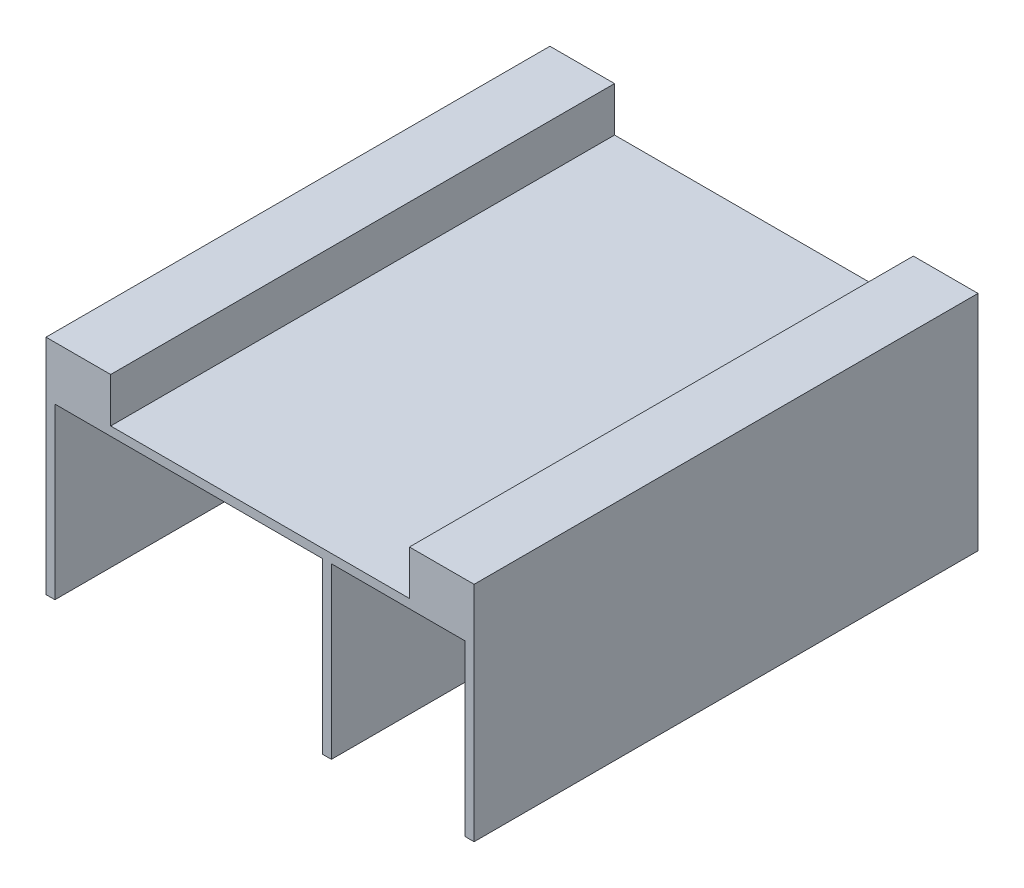
ISO-10303-21;
HEADER;
FILE_DESCRIPTION(('STEP AP214'),'2;1');
FILE_NAME('part.step','',(''),(''),'','','');
FILE_SCHEMA(('AUTOMOTIVE_DESIGN { 1 0 10303 214 1 1 1 1 }'));
ENDSEC;
DATA;
#1=APPLICATION_CONTEXT('core data for automotive mechanical design processes');
#2=APPLICATION_PROTOCOL_DEFINITION('international standard','automotive_design',2000,#1);
#3=PRODUCT_CONTEXT('',#1,'mechanical');
#4=PRODUCT('Part','Part','',(#3));
#5=PRODUCT_RELATED_PRODUCT_CATEGORY('part','',(#4));
#6=PRODUCT_DEFINITION_FORMATION('','',#4);
#7=PRODUCT_DEFINITION_CONTEXT('part definition',#1,'design');
#8=PRODUCT_DEFINITION('design','',#6,#7);
#9=PRODUCT_DEFINITION_SHAPE('','',#8);
#10=(LENGTH_UNIT() NAMED_UNIT(*) SI_UNIT(.MILLI.,.METRE.));
#11=(NAMED_UNIT(*) PLANE_ANGLE_UNIT() SI_UNIT($,.RADIAN.));
#12=(NAMED_UNIT(*) SI_UNIT($,.STERADIAN.) SOLID_ANGLE_UNIT());
#13=UNCERTAINTY_MEASURE_WITH_UNIT(LENGTH_MEASURE(1.E-05),#10,'distance_accuracy_value','');
#14=(GEOMETRIC_REPRESENTATION_CONTEXT(3) GLOBAL_UNCERTAINTY_ASSIGNED_CONTEXT((#13)) GLOBAL_UNIT_ASSIGNED_CONTEXT((#10,
#11,#12)) REPRESENTATION_CONTEXT('',''));
#15=CARTESIAN_POINT('',(0.,0.,0.));
#16=DIRECTION('',(0.,0.,1.));
#17=DIRECTION('',(1.,0.,0.));
#18=AXIS2_PLACEMENT_3D('',#15,#16,#17);
#19=CARTESIAN_POINT('',(0.,0.,0.));
#20=DIRECTION('',(0.,1.,0.));
#21=DIRECTION('',(0.,0.,1.));
#22=AXIS2_PLACEMENT_3D('',#19,#20,#21);
#23=PLANE('',#22);
#24=DIRECTION('',(1.,0.,0.));
#25=VECTOR('',#24,1.);
#26=CARTESIAN_POINT('',(0.,0.,-113.));
#27=LINE('',#26,#25);
#28=CARTESIAN_POINT('',(0.,0.,-113.));
#29=VERTEX_POINT('',#28);
#30=CARTESIAN_POINT('',(2.00000000000001,0.,-113.));
#31=VERTEX_POINT('',#30);
#32=EDGE_CURVE('E308',#29,#31,#27,.T.);
#33=ORIENTED_EDGE('',*,*,#32,.T.);
#34=DIRECTION('',(0.,0.,-1.));
#35=VECTOR('',#34,1.);
#36=CARTESIAN_POINT('',(2.,0.,0.));
#37=LINE('',#36,#35);
#38=CARTESIAN_POINT('',(2.,0.,0.));
#39=VERTEX_POINT('',#38);
#40=EDGE_CURVE('E221',#39,#31,#37,.T.);
#41=ORIENTED_EDGE('',*,*,#40,.F.);
#42=DIRECTION('',(1.,0.,0.));
#43=VECTOR('',#42,1.);
#44=CARTESIAN_POINT('',(0.,0.,0.));
#45=LINE('',#44,#43);
#46=CARTESIAN_POINT('',(0.,0.,0.));
#47=VERTEX_POINT('',#46);
#48=EDGE_CURVE('E300',#47,#39,#45,.T.);
#49=ORIENTED_EDGE('',*,*,#48,.F.);
#50=DIRECTION('',(0.,0.,-1.));
#51=VECTOR('',#50,1.);
#52=CARTESIAN_POINT('',(0.,0.,0.));
#53=LINE('',#52,#51);
#54=EDGE_CURVE('E311',#47,#29,#53,.T.);
#55=ORIENTED_EDGE('',*,*,#54,.T.);
#56=EDGE_LOOP('',(#33,#41,#49,#55));
#57=FACE_BOUND('',#56,.T.);
#58=ADVANCED_FACE('F33',(#57),#23,.F.);
#59=CARTESIAN_POINT('',(62.,0.,0.));
#60=VERTEX_POINT('',#59);
#61=CARTESIAN_POINT('',(64.,0.,0.));
#62=VERTEX_POINT('',#61);
#63=EDGE_CURVE('E304',#60,#62,#45,.T.);
#64=ORIENTED_EDGE('',*,*,#63,.F.);
#65=DIRECTION('',(0.,0.,1.));
#66=VECTOR('',#65,1.);
#67=CARTESIAN_POINT('',(62.,0.,0.));
#68=LINE('',#67,#66);
#69=CARTESIAN_POINT('',(62.,0.,-113.));
#70=VERTEX_POINT('',#69);
#71=EDGE_CURVE('E211',#70,#60,#68,.T.);
#72=ORIENTED_EDGE('',*,*,#71,.F.);
#73=CARTESIAN_POINT('',(64.,0.,-113.));
#74=VERTEX_POINT('',#73);
#75=EDGE_CURVE('E312',#70,#74,#27,.T.);
#76=ORIENTED_EDGE('',*,*,#75,.T.);
#77=DIRECTION('',(0.,0.,-1.));
#78=VECTOR('',#77,1.);
#79=CARTESIAN_POINT('',(64.,0.,0.));
#80=LINE('',#79,#78);
#81=EDGE_CURVE('E203',#62,#74,#80,.T.);
#82=ORIENTED_EDGE('',*,*,#81,.F.);
#83=EDGE_LOOP('',(#64,#72,#76,#82));
#84=FACE_BOUND('',#83,.T.);
#85=ADVANCED_FACE('F339',(#84),#23,.F.);
#86=CARTESIAN_POINT('',(0.,50.,0.));
#87=DIRECTION('',(0.,1.,0.));
#88=DIRECTION('',(0.,0.,1.));
#89=AXIS2_PLACEMENT_3D('',#86,#87,#88);
#90=PLANE('',#89);
#91=DIRECTION('',(0.,0.,1.));
#92=VECTOR('',#91,1.);
#93=CARTESIAN_POINT('',(14.5,50.,-113.));
#94=LINE('',#93,#92);
#95=CARTESIAN_POINT('',(14.5,50.,-113.));
#96=VERTEX_POINT('',#95);
#97=CARTESIAN_POINT('',(14.5,50.,0.));
#98=VERTEX_POINT('',#97);
#99=EDGE_CURVE('E227',#96,#98,#94,.T.);
#100=ORIENTED_EDGE('',*,*,#99,.F.);
#101=DIRECTION('',(1.,0.,0.));
#102=VECTOR('',#101,1.);
#103=CARTESIAN_POINT('',(0.,50.,-113.));
#104=LINE('',#103,#102);
#105=CARTESIAN_POINT('',(0.,50.,-113.));
#106=VERTEX_POINT('',#105);
#107=EDGE_CURVE('E293',#106,#96,#104,.T.);
#108=ORIENTED_EDGE('',*,*,#107,.F.);
#109=DIRECTION('',(0.,0.,-1.));
#110=VECTOR('',#109,1.);
#111=CARTESIAN_POINT('',(0.,50.,0.));
#112=LINE('',#111,#110);
#113=CARTESIAN_POINT('',(0.,50.,0.));
#114=VERTEX_POINT('',#113);
#115=EDGE_CURVE('E296',#114,#106,#112,.T.);
#116=ORIENTED_EDGE('',*,*,#115,.F.);
#117=DIRECTION('',(1.,0.,0.));
#118=VECTOR('',#117,1.);
#119=CARTESIAN_POINT('',(0.,50.,0.));
#120=LINE('',#119,#118);
#121=EDGE_CURVE('E285',#114,#98,#120,.T.);
#122=ORIENTED_EDGE('',*,*,#121,.T.);
#123=EDGE_LOOP('',(#100,#108,#116,#122));
#124=FACE_BOUND('',#123,.T.);
#125=ADVANCED_FACE('F370',(#124),#90,.T.);
#126=CARTESIAN_POINT('',(0.,50.,0.));
#127=DIRECTION('',(0.,0.,-1.));
#128=DIRECTION('',(-1.,0.,0.));
#129=AXIS2_PLACEMENT_3D('',#126,#127,#128);
#130=PLANE('',#129);
#131=ORIENTED_EDGE('',*,*,#48,.T.);
#132=DIRECTION('',(0.,-1.,0.));
#133=VECTOR('',#132,1.);
#134=CARTESIAN_POINT('',(2.,38.,0.));
#135=LINE('',#134,#133);
#136=CARTESIAN_POINT('',(2.,38.,0.));
#137=VERTEX_POINT('',#136);
#138=EDGE_CURVE('E225',#137,#39,#135,.T.);
#139=ORIENTED_EDGE('',*,*,#138,.F.);
#140=DIRECTION('',(-1.,0.,0.));
#141=VECTOR('',#140,1.);
#142=CARTESIAN_POINT('',(2.,38.,0.));
#143=LINE('',#142,#141);
#144=CARTESIAN_POINT('',(62.,38.,0.));
#145=VERTEX_POINT('',#144);
#146=EDGE_CURVE('E217',#145,#137,#143,.T.);
#147=ORIENTED_EDGE('',*,*,#146,.F.);
#148=DIRECTION('',(0.,-1.,0.));
#149=VECTOR('',#148,1.);
#150=CARTESIAN_POINT('',(62.,38.,0.));
#151=LINE('',#150,#149);
#152=EDGE_CURVE('E228',#145,#60,#151,.T.);
#153=ORIENTED_EDGE('',*,*,#152,.T.);
#154=ORIENTED_EDGE('',*,*,#63,.T.);
#155=DIRECTION('',(0.,-1.,0.));
#156=VECTOR('',#155,1.);
#157=CARTESIAN_POINT('',(64.,38.,0.));
#158=LINE('',#157,#156);
#159=CARTESIAN_POINT('',(64.,38.,0.));
#160=VERTEX_POINT('',#159);
#161=EDGE_CURVE('E223',#160,#62,#158,.T.);
#162=ORIENTED_EDGE('',*,*,#161,.F.);
#163=DIRECTION('',(-1.,0.,0.));
#164=VECTOR('',#163,1.);
#165=CARTESIAN_POINT('',(64.,38.,0.));
#166=LINE('',#165,#164);
#167=CARTESIAN_POINT('',(94.,38.,0.));
#168=VERTEX_POINT('',#167);
#169=EDGE_CURVE('E245',#168,#160,#166,.T.);
#170=ORIENTED_EDGE('',*,*,#169,.F.);
#171=DIRECTION('',(0.,-1.,0.));
#172=VECTOR('',#171,1.);
#173=CARTESIAN_POINT('',(94.,38.,0.));
#174=LINE('',#173,#172);
#175=CARTESIAN_POINT('',(94.,0.,0.));
#176=VERTEX_POINT('',#175);
#177=EDGE_CURVE('E252',#168,#176,#174,.T.);
#178=ORIENTED_EDGE('',*,*,#177,.T.);
#179=CARTESIAN_POINT('',(96.,0.,0.));
#180=VERTEX_POINT('',#179);
#181=EDGE_CURVE('E277',#176,#180,#45,.T.);
#182=ORIENTED_EDGE('',*,*,#181,.T.);
#183=DIRECTION('',(0.,-1.,0.));
#184=VECTOR('',#183,1.);
#185=CARTESIAN_POINT('',(96.,50.,0.));
#186=LINE('',#185,#184);
#187=CARTESIAN_POINT('',(96.,50.,0.));
#188=VERTEX_POINT('',#187);
#189=EDGE_CURVE('E11',#188,#180,#186,.T.);
#190=ORIENTED_EDGE('',*,*,#189,.F.);
#191=CARTESIAN_POINT('',(81.5,50.,0.));
#192=VERTEX_POINT('',#191);
#193=EDGE_CURVE('E289',#192,#188,#120,.T.);
#194=ORIENTED_EDGE('',*,*,#193,.F.);
#195=DIRECTION('',(0.,1.,0.));
#196=VECTOR('',#195,1.);
#197=CARTESIAN_POINT('',(81.5,40.,0.));
#198=LINE('',#197,#196);
#199=CARTESIAN_POINT('',(81.5,40.,0.));
#200=VERTEX_POINT('',#199);
#201=EDGE_CURVE('E281',#200,#192,#198,.T.);
#202=ORIENTED_EDGE('',*,*,#201,.F.);
#203=DIRECTION('',(1.,0.,0.));
#204=VECTOR('',#203,1.);
#205=CARTESIAN_POINT('',(14.5,40.,0.));
#206=LINE('',#205,#204);
#207=CARTESIAN_POINT('',(14.5,40.,0.));
#208=VERTEX_POINT('',#207);
#209=EDGE_CURVE('E262',#208,#200,#206,.T.);
#210=ORIENTED_EDGE('',*,*,#209,.F.);
#211=DIRECTION('',(0.,1.,0.));
#212=VECTOR('',#211,1.);
#213=CARTESIAN_POINT('',(14.5,40.,0.));
#214=LINE('',#213,#212);
#215=EDGE_CURVE('E272',#208,#98,#214,.T.);
#216=ORIENTED_EDGE('',*,*,#215,.T.);
#217=ORIENTED_EDGE('',*,*,#121,.F.);
#218=DIRECTION('',(0.,-1.,0.));
#219=VECTOR('',#218,1.);
#220=CARTESIAN_POINT('',(0.,50.,0.));
#221=LINE('',#220,#219);
#222=EDGE_CURVE('E299',#114,#47,#221,.T.);
#223=ORIENTED_EDGE('',*,*,#222,.T.);
#224=EDGE_LOOP('',(#131,#139,#147,#153,#154,#162,#170,#178,#182,#190,#194,#202,#210,#216,#217,#223));
#225=FACE_BOUND('',#224,.T.);
#226=ADVANCED_FACE('F35',(#225),#130,.F.);
#227=CARTESIAN_POINT('',(96.,50.,0.));
#228=DIRECTION('',(-1.,0.,0.));
#229=DIRECTION('',(0.,0.,1.));
#230=AXIS2_PLACEMENT_3D('',#227,#228,#229);
#231=PLANE('',#230);
#232=DIRECTION('',(0.,0.,-1.));
#233=VECTOR('',#232,1.);
#234=CARTESIAN_POINT('',(96.,0.,0.));
#235=LINE('',#234,#233);
#236=CARTESIAN_POINT('',(96.,0.,-113.));
#237=VERTEX_POINT('',#236);
#238=EDGE_CURVE('E303',#180,#237,#235,.T.);
#239=ORIENTED_EDGE('',*,*,#238,.T.);
#240=DIRECTION('',(0.,-1.,0.));
#241=VECTOR('',#240,1.);
#242=CARTESIAN_POINT('',(96.,50.,-113.));
#243=LINE('',#242,#241);
#244=CARTESIAN_POINT('',(96.,50.,-113.));
#245=VERTEX_POINT('',#244);
#246=EDGE_CURVE('E41',#245,#237,#243,.T.);
#247=ORIENTED_EDGE('',*,*,#246,.F.);
#248=DIRECTION('',(0.,0.,-1.));
#249=VECTOR('',#248,1.);
#250=CARTESIAN_POINT('',(96.,50.,0.));
#251=LINE('',#250,#249);
#252=EDGE_CURVE('E288',#188,#245,#251,.T.);
#253=ORIENTED_EDGE('',*,*,#252,.F.);
#254=ORIENTED_EDGE('',*,*,#189,.T.);
#255=EDGE_LOOP('',(#239,#247,#253,#254));
#256=FACE_BOUND('',#255,.T.);
#257=ADVANCED_FACE('F327',(#256),#231,.F.);
#258=CARTESIAN_POINT('',(0.,50.,-113.));
#259=DIRECTION('',(0.,0.,-1.));
#260=DIRECTION('',(-1.,0.,0.));
#261=AXIS2_PLACEMENT_3D('',#258,#259,#260);
#262=PLANE('',#261);
#263=DIRECTION('',(0.,-1.,0.));
#264=VECTOR('',#263,1.);
#265=CARTESIAN_POINT('',(2.00000000000001,38.,-113.));
#266=LINE('',#265,#264);
#267=CARTESIAN_POINT('',(2.00000000000001,38.,-113.));
#268=VERTEX_POINT('',#267);
#269=EDGE_CURVE('E220',#268,#31,#266,.T.);
#270=ORIENTED_EDGE('',*,*,#269,.T.);
#271=ORIENTED_EDGE('',*,*,#32,.F.);
#272=DIRECTION('',(0.,-1.,0.));
#273=VECTOR('',#272,1.);
#274=CARTESIAN_POINT('',(0.,50.,-113.));
#275=LINE('',#274,#273);
#276=EDGE_CURVE('E316',#106,#29,#275,.T.);
#277=ORIENTED_EDGE('',*,*,#276,.F.);
#278=ORIENTED_EDGE('',*,*,#107,.T.);
#279=DIRECTION('',(0.,1.,0.));
#280=VECTOR('',#279,1.);
#281=CARTESIAN_POINT('',(14.5,40.,-113.));
#282=LINE('',#281,#280);
#283=CARTESIAN_POINT('',(14.5,40.,-113.));
#284=VERTEX_POINT('',#283);
#285=EDGE_CURVE('E275',#284,#96,#282,.T.);
#286=ORIENTED_EDGE('',*,*,#285,.F.);
#287=DIRECTION('',(-1.,0.,0.));
#288=VECTOR('',#287,1.);
#289=CARTESIAN_POINT('',(14.5,40.,-113.));
#290=LINE('',#289,#288);
#291=CARTESIAN_POINT('',(81.5,40.,-113.));
#292=VERTEX_POINT('',#291);
#293=EDGE_CURVE('E269',#292,#284,#290,.T.);
#294=ORIENTED_EDGE('',*,*,#293,.F.);
#295=DIRECTION('',(0.,1.,0.));
#296=VECTOR('',#295,1.);
#297=CARTESIAN_POINT('',(81.5,40.,-113.));
#298=LINE('',#297,#296);
#299=CARTESIAN_POINT('',(81.5,50.,-113.));
#300=VERTEX_POINT('',#299);
#301=EDGE_CURVE('E278',#292,#300,#298,.T.);
#302=ORIENTED_EDGE('',*,*,#301,.T.);
#303=EDGE_CURVE('E292',#300,#245,#104,.T.);
#304=ORIENTED_EDGE('',*,*,#303,.T.);
#305=ORIENTED_EDGE('',*,*,#246,.T.);
#306=CARTESIAN_POINT('',(94.,0.,-113.));
#307=VERTEX_POINT('',#306);
#308=EDGE_CURVE('E307',#307,#237,#27,.T.);
#309=ORIENTED_EDGE('',*,*,#308,.F.);
#310=DIRECTION('',(0.,-1.,0.));
#311=VECTOR('',#310,1.);
#312=CARTESIAN_POINT('',(94.,38.,-113.));
#313=LINE('',#312,#311);
#314=CARTESIAN_POINT('',(94.,38.,-113.));
#315=VERTEX_POINT('',#314);
#316=EDGE_CURVE('E255',#315,#307,#313,.T.);
#317=ORIENTED_EDGE('',*,*,#316,.F.);
#318=DIRECTION('',(1.,0.,0.));
#319=VECTOR('',#318,1.);
#320=CARTESIAN_POINT('',(64.,38.,-113.));
#321=LINE('',#320,#319);
#322=CARTESIAN_POINT('',(64.,38.,-113.));
#323=VERTEX_POINT('',#322);
#324=EDGE_CURVE('E238',#323,#315,#321,.T.);
#325=ORIENTED_EDGE('',*,*,#324,.F.);
#326=DIRECTION('',(0.,-1.,0.));
#327=VECTOR('',#326,1.);
#328=CARTESIAN_POINT('',(64.,38.,-113.));
#329=LINE('',#328,#327);
#330=EDGE_CURVE('E248',#323,#74,#329,.T.);
#331=ORIENTED_EDGE('',*,*,#330,.T.);
#332=ORIENTED_EDGE('',*,*,#75,.F.);
#333=DIRECTION('',(0.,-1.,0.));
#334=VECTOR('',#333,1.);
#335=CARTESIAN_POINT('',(62.,38.,-113.));
#336=LINE('',#335,#334);
#337=CARTESIAN_POINT('',(62.,38.,-113.));
#338=VERTEX_POINT('',#337);
#339=EDGE_CURVE('E231',#338,#70,#336,.T.);
#340=ORIENTED_EDGE('',*,*,#339,.F.);
#341=DIRECTION('',(1.,0.,0.));
#342=VECTOR('',#341,1.);
#343=CARTESIAN_POINT('',(2.00000000000001,38.,-113.));
#344=LINE('',#343,#342);
#345=EDGE_CURVE('E210',#268,#338,#344,.T.);
#346=ORIENTED_EDGE('',*,*,#345,.F.);
#347=EDGE_LOOP('',(#270,#271,#277,#278,#286,#294,#302,#304,#305,#309,#317,#325,#331,#332,#340,#346));
#348=FACE_BOUND('',#347,.T.);
#349=ADVANCED_FACE('F321',(#348),#262,.T.);
#350=CARTESIAN_POINT('',(0.,50.,0.));
#351=DIRECTION('',(-1.,0.,0.));
#352=DIRECTION('',(0.,0.,1.));
#353=AXIS2_PLACEMENT_3D('',#350,#351,#352);
#354=PLANE('',#353);
#355=DIRECTION('',(0.,-1.,0.));
#356=VECTOR('',#355,1.);
#357=CARTESIAN_POINT('',(0.,36.,-106.));
#358=LINE('',#357,#356);
#359=CARTESIAN_POINT('',(0.,36.,-106.));
#360=VERTEX_POINT('',#359);
#361=CARTESIAN_POINT('',(0.,21.,-106.));
#362=VERTEX_POINT('',#361);
#363=EDGE_CURVE('E48',#360,#362,#358,.T.);
#364=ORIENTED_EDGE('',*,*,#363,.F.);
#365=DIRECTION('',(0.,0.,-1.));
#366=VECTOR('',#365,1.);
#367=CARTESIAN_POINT('',(0.,36.,-106.));
#368=LINE('',#367,#366);
#369=CARTESIAN_POINT('',(0.,36.,-26.));
#370=VERTEX_POINT('',#369);
#371=EDGE_CURVE('E188',#370,#360,#368,.T.);
#372=ORIENTED_EDGE('',*,*,#371,.F.);
#373=DIRECTION('',(0.,1.,0.));
#374=VECTOR('',#373,1.);
#375=CARTESIAN_POINT('',(0.,36.,-26.));
#376=LINE('',#375,#374);
#377=CARTESIAN_POINT('',(0.,21.,-26.));
#378=VERTEX_POINT('',#377);
#379=EDGE_CURVE('E191',#378,#370,#376,.T.);
#380=ORIENTED_EDGE('',*,*,#379,.F.);
#381=DIRECTION('',(0.,0.,1.));
#382=VECTOR('',#381,1.);
#383=CARTESIAN_POINT('',(0.,21.,-106.));
#384=LINE('',#383,#382);
#385=EDGE_CURVE('E197',#362,#378,#384,.T.);
#386=ORIENTED_EDGE('',*,*,#385,.F.);
#387=EDGE_LOOP('',(#364,#372,#380,#386));
#388=FACE_BOUND('',#387,.T.);
#389=ORIENTED_EDGE('',*,*,#54,.F.);
#390=ORIENTED_EDGE('',*,*,#222,.F.);
#391=ORIENTED_EDGE('',*,*,#115,.T.);
#392=ORIENTED_EDGE('',*,*,#276,.T.);
#393=EDGE_LOOP('',(#389,#390,#391,#392));
#394=FACE_BOUND('',#393,.T.);
#395=ADVANCED_FACE('F383',(#388,#394),#354,.T.);
#396=DIRECTION('',(0.,0.,-1.));
#397=VECTOR('',#396,1.);
#398=CARTESIAN_POINT('',(81.5,50.,-113.));
#399=LINE('',#398,#397);
#400=EDGE_CURVE('E263',#192,#300,#399,.T.);
#401=ORIENTED_EDGE('',*,*,#400,.F.);
#402=ORIENTED_EDGE('',*,*,#193,.T.);
#403=ORIENTED_EDGE('',*,*,#252,.T.);
#404=ORIENTED_EDGE('',*,*,#303,.F.);
#405=EDGE_LOOP('',(#401,#402,#403,#404));
#406=FACE_BOUND('',#405,.T.);
#407=ADVANCED_FACE('F375',(#406),#90,.T.);
#408=ORIENTED_EDGE('',*,*,#181,.F.);
#409=DIRECTION('',(0.,0.,1.));
#410=VECTOR('',#409,1.);
#411=CARTESIAN_POINT('',(94.,0.,0.));
#412=LINE('',#411,#410);
#413=EDGE_CURVE('E239',#307,#176,#412,.T.);
#414=ORIENTED_EDGE('',*,*,#413,.F.);
#415=ORIENTED_EDGE('',*,*,#308,.T.);
#416=ORIENTED_EDGE('',*,*,#238,.F.);
#417=EDGE_LOOP('',(#408,#414,#415,#416));
#418=FACE_BOUND('',#417,.T.);
#419=ADVANCED_FACE('F331',(#418),#23,.F.);
#420=CARTESIAN_POINT('',(14.5,40.,-113.));
#421=DIRECTION('',(-1.,0.,0.));
#422=DIRECTION('',(0.,0.,1.));
#423=AXIS2_PLACEMENT_3D('',#420,#421,#422);
#424=PLANE('',#423);
#425=ORIENTED_EDGE('',*,*,#99,.T.);
#426=ORIENTED_EDGE('',*,*,#215,.F.);
#427=DIRECTION('',(0.,0.,1.));
#428=VECTOR('',#427,1.);
#429=CARTESIAN_POINT('',(14.5,40.,-113.));
#430=LINE('',#429,#428);
#431=EDGE_CURVE('E259',#284,#208,#430,.T.);
#432=ORIENTED_EDGE('',*,*,#431,.F.);
#433=ORIENTED_EDGE('',*,*,#285,.T.);
#434=EDGE_LOOP('',(#425,#426,#432,#433));
#435=FACE_BOUND('',#434,.T.);
#436=ADVANCED_FACE('F374',(#435),#424,.F.);
#437=CARTESIAN_POINT('',(81.5,40.,-113.));
#438=DIRECTION('',(1.,0.,0.));
#439=DIRECTION('',(0.,0.,-1.));
#440=AXIS2_PLACEMENT_3D('',#437,#438,#439);
#441=PLANE('',#440);
#442=ORIENTED_EDGE('',*,*,#400,.T.);
#443=ORIENTED_EDGE('',*,*,#301,.F.);
#444=DIRECTION('',(0.,0.,-1.));
#445=VECTOR('',#444,1.);
#446=CARTESIAN_POINT('',(81.5,40.,-113.));
#447=LINE('',#446,#445);
#448=EDGE_CURVE('E266',#200,#292,#447,.T.);
#449=ORIENTED_EDGE('',*,*,#448,.F.);
#450=ORIENTED_EDGE('',*,*,#201,.T.);
#451=EDGE_LOOP('',(#442,#443,#449,#450));
#452=FACE_BOUND('',#451,.T.);
#453=ADVANCED_FACE('F380',(#452),#441,.F.);
#454=CARTESIAN_POINT('',(0.,40.,0.));
#455=DIRECTION('',(0.,1.,0.));
#456=DIRECTION('',(0.,0.,1.));
#457=AXIS2_PLACEMENT_3D('',#454,#455,#456);
#458=PLANE('',#457);
#459=ORIENTED_EDGE('',*,*,#431,.T.);
#460=ORIENTED_EDGE('',*,*,#209,.T.);
#461=ORIENTED_EDGE('',*,*,#448,.T.);
#462=ORIENTED_EDGE('',*,*,#293,.T.);
#463=EDGE_LOOP('',(#459,#460,#461,#462));
#464=FACE_BOUND('',#463,.T.);
#465=ADVANCED_FACE('F362',(#464),#458,.T.);
#466=CARTESIAN_POINT('',(64.,38.,0.));
#467=DIRECTION('',(-1.,0.,0.));
#468=DIRECTION('',(0.,0.,1.));
#469=AXIS2_PLACEMENT_3D('',#466,#467,#468);
#470=PLANE('',#469);
#471=ORIENTED_EDGE('',*,*,#81,.T.);
#472=ORIENTED_EDGE('',*,*,#330,.F.);
#473=DIRECTION('',(0.,0.,-1.));
#474=VECTOR('',#473,1.);
#475=CARTESIAN_POINT('',(64.,38.,0.));
#476=LINE('',#475,#474);
#477=EDGE_CURVE('E235',#160,#323,#476,.T.);
#478=ORIENTED_EDGE('',*,*,#477,.F.);
#479=ORIENTED_EDGE('',*,*,#161,.T.);
#480=EDGE_LOOP('',(#471,#472,#478,#479));
#481=FACE_BOUND('',#480,.T.);
#482=ADVANCED_FACE('F345',(#481),#470,.F.);
#483=CARTESIAN_POINT('',(94.,38.,0.));
#484=DIRECTION('',(1.,0.,0.));
#485=DIRECTION('',(0.,0.,-1.));
#486=AXIS2_PLACEMENT_3D('',#483,#484,#485);
#487=PLANE('',#486);
#488=ORIENTED_EDGE('',*,*,#413,.T.);
#489=ORIENTED_EDGE('',*,*,#177,.F.);
#490=DIRECTION('',(0.,0.,1.));
#491=VECTOR('',#490,1.);
#492=CARTESIAN_POINT('',(94.,38.,0.));
#493=LINE('',#492,#491);
#494=EDGE_CURVE('E242',#315,#168,#493,.T.);
#495=ORIENTED_EDGE('',*,*,#494,.F.);
#496=ORIENTED_EDGE('',*,*,#316,.T.);
#497=EDGE_LOOP('',(#488,#489,#495,#496));
#498=FACE_BOUND('',#497,.T.);
#499=ADVANCED_FACE('F354',(#498),#487,.F.);
#500=CARTESIAN_POINT('',(0.,38.,0.));
#501=DIRECTION('',(0.,-1.,0.));
#502=DIRECTION('',(0.,0.,-1.));
#503=AXIS2_PLACEMENT_3D('',#500,#501,#502);
#504=PLANE('',#503);
#505=ORIENTED_EDGE('',*,*,#477,.T.);
#506=ORIENTED_EDGE('',*,*,#324,.T.);
#507=ORIENTED_EDGE('',*,*,#494,.T.);
#508=ORIENTED_EDGE('',*,*,#169,.T.);
#509=EDGE_LOOP('',(#505,#506,#507,#508));
#510=FACE_BOUND('',#509,.T.);
#511=ADVANCED_FACE('F347',(#510),#504,.T.);
#512=CARTESIAN_POINT('',(2.,38.,0.));
#513=DIRECTION('',(-1.,0.,0.));
#514=DIRECTION('',(0.,0.,1.));
#515=AXIS2_PLACEMENT_3D('',#512,#513,#514);
#516=PLANE('',#515);
#517=DIRECTION('',(0.,0.,-1.));
#518=VECTOR('',#517,1.);
#519=CARTESIAN_POINT('',(2.,36.,-106.));
#520=LINE('',#519,#518);
#521=CARTESIAN_POINT('',(2.,36.,-26.));
#522=VERTEX_POINT('',#521);
#523=CARTESIAN_POINT('',(2.,36.,-106.));
#524=VERTEX_POINT('',#523);
#525=EDGE_CURVE('E178',#522,#524,#520,.T.);
#526=ORIENTED_EDGE('',*,*,#525,.T.);
#527=DIRECTION('',(0.,-1.,0.));
#528=VECTOR('',#527,1.);
#529=CARTESIAN_POINT('',(2.,36.,-106.));
#530=LINE('',#529,#528);
#531=CARTESIAN_POINT('',(2.,21.,-106.));
#532=VERTEX_POINT('',#531);
#533=EDGE_CURVE('E172',#524,#532,#530,.T.);
#534=ORIENTED_EDGE('',*,*,#533,.T.);
#535=DIRECTION('',(0.,0.,1.));
#536=VECTOR('',#535,1.);
#537=CARTESIAN_POINT('',(2.,21.,-106.));
#538=LINE('',#537,#536);
#539=CARTESIAN_POINT('',(2.,21.,-26.));
#540=VERTEX_POINT('',#539);
#541=EDGE_CURVE('E181',#532,#540,#538,.T.);
#542=ORIENTED_EDGE('',*,*,#541,.T.);
#543=DIRECTION('',(0.,1.,0.));
#544=VECTOR('',#543,1.);
#545=CARTESIAN_POINT('',(2.,36.,-26.));
#546=LINE('',#545,#544);
#547=EDGE_CURVE('E56',#540,#522,#546,.T.);
#548=ORIENTED_EDGE('',*,*,#547,.T.);
#549=EDGE_LOOP('',(#526,#534,#542,#548));
#550=FACE_BOUND('',#549,.T.);
#551=ORIENTED_EDGE('',*,*,#40,.T.);
#552=ORIENTED_EDGE('',*,*,#269,.F.);
#553=DIRECTION('',(0.,0.,-1.));
#554=VECTOR('',#553,1.);
#555=CARTESIAN_POINT('',(2.,38.,0.));
#556=LINE('',#555,#554);
#557=EDGE_CURVE('E207',#137,#268,#556,.T.);
#558=ORIENTED_EDGE('',*,*,#557,.F.);
#559=ORIENTED_EDGE('',*,*,#138,.T.);
#560=EDGE_LOOP('',(#551,#552,#558,#559));
#561=FACE_BOUND('',#560,.T.);
#562=ADVANCED_FACE('F185',(#550,#561),#516,.F.);
#563=CARTESIAN_POINT('',(62.,38.,0.));
#564=DIRECTION('',(1.,0.,0.));
#565=DIRECTION('',(0.,0.,-1.));
#566=AXIS2_PLACEMENT_3D('',#563,#564,#565);
#567=PLANE('',#566);
#568=ORIENTED_EDGE('',*,*,#71,.T.);
#569=ORIENTED_EDGE('',*,*,#152,.F.);
#570=DIRECTION('',(0.,0.,1.));
#571=VECTOR('',#570,1.);
#572=CARTESIAN_POINT('',(62.,38.,0.));
#573=LINE('',#572,#571);
#574=EDGE_CURVE('E214',#338,#145,#573,.T.);
#575=ORIENTED_EDGE('',*,*,#574,.F.);
#576=ORIENTED_EDGE('',*,*,#339,.T.);
#577=EDGE_LOOP('',(#568,#569,#575,#576));
#578=FACE_BOUND('',#577,.T.);
#579=ADVANCED_FACE('F442',(#578),#567,.F.);
#580=CARTESIAN_POINT('',(0.,38.,0.));
#581=DIRECTION('',(0.,-1.,0.));
#582=DIRECTION('',(0.,0.,-1.));
#583=AXIS2_PLACEMENT_3D('',#580,#581,#582);
#584=PLANE('',#583);
#585=ORIENTED_EDGE('',*,*,#557,.T.);
#586=ORIENTED_EDGE('',*,*,#345,.T.);
#587=ORIENTED_EDGE('',*,*,#574,.T.);
#588=ORIENTED_EDGE('',*,*,#146,.T.);
#589=EDGE_LOOP('',(#585,#586,#587,#588));
#590=FACE_BOUND('',#589,.T.);
#591=ADVANCED_FACE('F447',(#590),#584,.T.);
#592=CARTESIAN_POINT('',(2.,36.,-106.));
#593=DIRECTION('',(0.,0.,-1.));
#594=DIRECTION('',(-1.,0.,0.));
#595=AXIS2_PLACEMENT_3D('',#592,#593,#594);
#596=PLANE('',#595);
#597=ORIENTED_EDGE('',*,*,#363,.T.);
#598=DIRECTION('',(-1.,0.,0.));
#599=VECTOR('',#598,1.);
#600=CARTESIAN_POINT('',(2.,21.,-106.));
#601=LINE('',#600,#599);
#602=EDGE_CURVE('E168',#532,#362,#601,.T.);
#603=ORIENTED_EDGE('',*,*,#602,.F.);
#604=ORIENTED_EDGE('',*,*,#533,.F.);
#605=DIRECTION('',(-1.,0.,0.));
#606=VECTOR('',#605,1.);
#607=CARTESIAN_POINT('',(2.,36.,-106.));
#608=LINE('',#607,#606);
#609=EDGE_CURVE('E201',#524,#360,#608,.T.);
#610=ORIENTED_EDGE('',*,*,#609,.T.);
#611=EDGE_LOOP('',(#597,#603,#604,#610));
#612=FACE_BOUND('',#611,.T.);
#613=ADVANCED_FACE('F170',(#612),#596,.F.);
#614=CARTESIAN_POINT('',(2.,36.,-106.));
#615=DIRECTION('',(0.,1.,0.));
#616=DIRECTION('',(0.,0.,1.));
#617=AXIS2_PLACEMENT_3D('',#614,#615,#616);
#618=PLANE('',#617);
#619=ORIENTED_EDGE('',*,*,#371,.T.);
#620=ORIENTED_EDGE('',*,*,#609,.F.);
#621=ORIENTED_EDGE('',*,*,#525,.F.);
#622=DIRECTION('',(-1.,0.,0.));
#623=VECTOR('',#622,1.);
#624=CARTESIAN_POINT('',(2.,36.,-26.));
#625=LINE('',#624,#623);
#626=EDGE_CURVE('E204',#522,#370,#625,.T.);
#627=ORIENTED_EDGE('',*,*,#626,.T.);
#628=EDGE_LOOP('',(#619,#620,#621,#627));
#629=FACE_BOUND('',#628,.T.);
#630=ADVANCED_FACE('F481',(#629),#618,.F.);
#631=CARTESIAN_POINT('',(2.,36.,-26.));
#632=DIRECTION('',(0.,0.,1.));
#633=DIRECTION('',(1.,0.,0.));
#634=AXIS2_PLACEMENT_3D('',#631,#632,#633);
#635=PLANE('',#634);
#636=ORIENTED_EDGE('',*,*,#379,.T.);
#637=ORIENTED_EDGE('',*,*,#626,.F.);
#638=ORIENTED_EDGE('',*,*,#547,.F.);
#639=DIRECTION('',(-1.,0.,0.));
#640=VECTOR('',#639,1.);
#641=CARTESIAN_POINT('',(2.,21.,-26.));
#642=LINE('',#641,#640);
#643=EDGE_CURVE('E177',#540,#378,#642,.T.);
#644=ORIENTED_EDGE('',*,*,#643,.T.);
#645=EDGE_LOOP('',(#636,#637,#638,#644));
#646=FACE_BOUND('',#645,.T.);
#647=ADVANCED_FACE('F490',(#646),#635,.F.);
#648=CARTESIAN_POINT('',(2.,21.,-106.));
#649=DIRECTION('',(0.,-1.,0.));
#650=DIRECTION('',(0.,0.,-1.));
#651=AXIS2_PLACEMENT_3D('',#648,#649,#650);
#652=PLANE('',#651);
#653=ORIENTED_EDGE('',*,*,#385,.T.);
#654=ORIENTED_EDGE('',*,*,#643,.F.);
#655=ORIENTED_EDGE('',*,*,#541,.F.);
#656=ORIENTED_EDGE('',*,*,#602,.T.);
#657=EDGE_LOOP('',(#653,#654,#655,#656));
#658=FACE_BOUND('',#657,.T.);
#659=ADVANCED_FACE('F182',(#658),#652,.F.);
#660=CLOSED_SHELL('',(#58,#85,#125,#226,#257,#349,#395,#407,#419,#436,#453,#465,#482,#499,#511,
#562,#579,#591,#613,#630,#647,#659));
#661=MANIFOLD_SOLID_BREP('B2',#660);
#662=ADVANCED_BREP_SHAPE_REPRESENTATION('',(#18,#661),#14);
#663=SHAPE_DEFINITION_REPRESENTATION(#9,#662);
ENDSEC;
END-ISO-10303-21;
